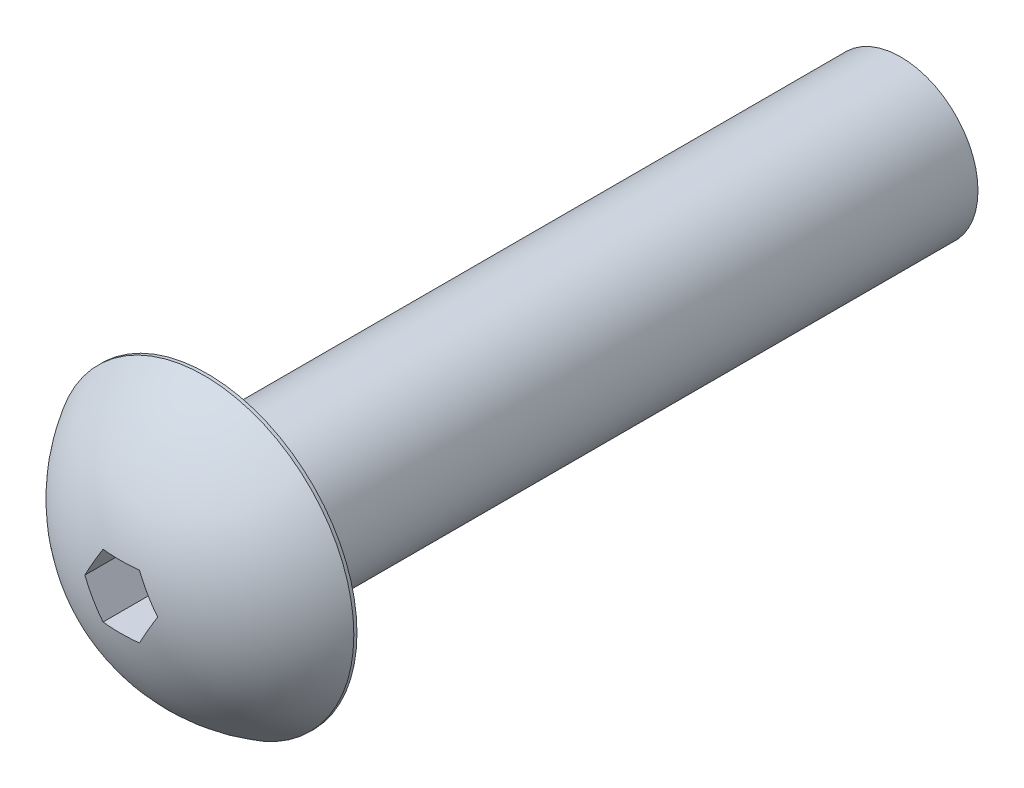
ISO-10303-21;
HEADER;
FILE_DESCRIPTION(('STEP AP214'),'2;1');
FILE_NAME('part.step','',(''),(''),'','','');
FILE_SCHEMA(('AUTOMOTIVE_DESIGN { 1 0 10303 214 1 1 1 1 }'));
ENDSEC;
DATA;
#1=APPLICATION_CONTEXT('core data for automotive mechanical design processes');
#2=APPLICATION_PROTOCOL_DEFINITION('international standard','automotive_design',2000,#1);
#3=PRODUCT_CONTEXT('',#1,'mechanical');
#4=PRODUCT('Part','Part','',(#3));
#5=PRODUCT_RELATED_PRODUCT_CATEGORY('part','',(#4));
#6=PRODUCT_DEFINITION_FORMATION('','',#4);
#7=PRODUCT_DEFINITION_CONTEXT('part definition',#1,'design');
#8=PRODUCT_DEFINITION('design','',#6,#7);
#9=PRODUCT_DEFINITION_SHAPE('','',#8);
#10=(LENGTH_UNIT() NAMED_UNIT(*) SI_UNIT(.MILLI.,.METRE.));
#11=(NAMED_UNIT(*) PLANE_ANGLE_UNIT() SI_UNIT($,.RADIAN.));
#12=(NAMED_UNIT(*) SI_UNIT($,.STERADIAN.) SOLID_ANGLE_UNIT());
#13=UNCERTAINTY_MEASURE_WITH_UNIT(LENGTH_MEASURE(1.E-05),#10,'distance_accuracy_value','');
#14=(GEOMETRIC_REPRESENTATION_CONTEXT(3) GLOBAL_UNCERTAINTY_ASSIGNED_CONTEXT((#13)) GLOBAL_UNIT_ASSIGNED_CONTEXT((#10,
#11,#12)) REPRESENTATION_CONTEXT('',''));
#15=CARTESIAN_POINT('',(0.,0.,0.));
#16=DIRECTION('',(0.,0.,1.));
#17=DIRECTION('',(1.,0.,0.));
#18=AXIS2_PLACEMENT_3D('',#15,#16,#17);
#19=CARTESIAN_POINT('',(0.,0.,22.));
#20=DIRECTION('',(0.,0.,-1.));
#21=DIRECTION('',(-1.,0.,0.));
#22=AXIS2_PLACEMENT_3D('',#19,#20,#21);
#23=CYLINDRICAL_SURFACE('',#22,2.45);
#24=CARTESIAN_POINT('',(0.,0.,22.));
#25=DIRECTION('',(0.,0.,1.));
#26=DIRECTION('',(1.,0.,0.));
#27=AXIS2_PLACEMENT_3D('',#24,#25,#26);
#28=CIRCLE('',#27,2.45);
#29=CARTESIAN_POINT('',(2.45,0.,22.));
#30=VERTEX_POINT('',#29);
#31=EDGE_CURVE('E128',#30,#30,#28,.T.);
#32=ORIENTED_EDGE('',*,*,#31,.F.);
#33=EDGE_LOOP('',(#32));
#34=FACE_BOUND('',#33,.T.);
#35=CARTESIAN_POINT('',(0.,0.,0.));
#36=DIRECTION('',(0.,0.,1.));
#37=DIRECTION('',(1.,0.,0.));
#38=AXIS2_PLACEMENT_3D('',#35,#36,#37);
#39=CIRCLE('',#38,2.45);
#40=CARTESIAN_POINT('',(2.45,0.,0.));
#41=VERTEX_POINT('',#40);
#42=EDGE_CURVE('E131',#41,#41,#39,.T.);
#43=ORIENTED_EDGE('',*,*,#42,.T.);
#44=EDGE_LOOP('',(#43));
#45=FACE_BOUND('',#44,.T.);
#46=ADVANCED_FACE('F35',(#34,#45),#23,.T.);
#47=CARTESIAN_POINT('',(0.,0.,0.));
#48=DIRECTION('',(0.,0.,1.));
#49=DIRECTION('',(1.,0.,0.));
#50=AXIS2_PLACEMENT_3D('',#47,#48,#49);
#51=PLANE('',#50);
#52=ORIENTED_EDGE('',*,*,#42,.F.);
#53=EDGE_LOOP('',(#52));
#54=FACE_BOUND('',#53,.T.);
#55=ADVANCED_FACE('F169',(#54),#51,.F.);
#56=CARTESIAN_POINT('',(0.,0.,22.));
#57=DIRECTION('',(0.,0.,1.));
#58=DIRECTION('',(1.,0.,0.));
#59=AXIS2_PLACEMENT_3D('',#56,#57,#58);
#60=PLANE('',#59);
#61=CARTESIAN_POINT('',(0.,0.,22.));
#62=DIRECTION('',(0.,0.,1.));
#63=DIRECTION('',(1.,0.,0.));
#64=AXIS2_PLACEMENT_3D('',#61,#62,#63);
#65=CIRCLE('',#64,4.75);
#66=CARTESIAN_POINT('',(4.75,0.,22.));
#67=VERTEX_POINT('',#66);
#68=EDGE_CURVE('E117',#67,#67,#65,.T.);
#69=ORIENTED_EDGE('',*,*,#68,.F.);
#70=EDGE_LOOP('',(#69));
#71=FACE_BOUND('',#70,.T.);
#72=ORIENTED_EDGE('',*,*,#31,.T.);
#73=EDGE_LOOP('',(#72));
#74=FACE_BOUND('',#73,.T.);
#75=ADVANCED_FACE('F174',(#71,#74),#60,.F.);
#76=CARTESIAN_POINT('',(0.,0.,22.1));
#77=DIRECTION('',(0.,0.,-1.));
#78=DIRECTION('',(-1.,0.,0.));
#79=AXIS2_PLACEMENT_3D('',#76,#77,#78);
#80=CYLINDRICAL_SURFACE('',#79,4.75);
#81=CARTESIAN_POINT('',(0.,0.,22.1));
#82=DIRECTION('',(0.,0.,1.));
#83=DIRECTION('',(1.,0.,0.));
#84=AXIS2_PLACEMENT_3D('',#81,#82,#83);
#85=CIRCLE('',#84,4.75);
#86=CARTESIAN_POINT('',(4.75,0.,22.1));
#87=VERTEX_POINT('',#86);
#88=EDGE_CURVE('E127',#87,#87,#85,.T.);
#89=ORIENTED_EDGE('',*,*,#88,.F.);
#90=EDGE_LOOP('',(#89));
#91=FACE_BOUND('',#90,.T.);
#92=ORIENTED_EDGE('',*,*,#68,.T.);
#93=EDGE_LOOP('',(#92));
#94=FACE_BOUND('',#93,.T.);
#95=ADVANCED_FACE('F180',(#91,#94),#80,.T.);
#96=CARTESIAN_POINT('',(0.,0.,19.3727272727273));
#97=DIRECTION('',(0.,0.,1.));
#98=DIRECTION('',(1.,0.,0.));
#99=AXIS2_PLACEMENT_3D('',#96,#97,#98);
#100=SPHERICAL_SURFACE('',#99,5.47727272727273);
#101=CARTESIAN_POINT('',(0.,1.,19.3727272727273));
#102=DIRECTION('',(0.,1.,0.));
#103=DIRECTION('',(-1.,0.,0.));
#104=AXIS2_PLACEMENT_3D('',#101,#102,#103);
#105=CIRCLE('',#104,5.38521276542772);
#106=CARTESIAN_POINT('',(0.577350269189626,1.,24.7269016437757));
#107=VERTEX_POINT('',#106);
#108=CARTESIAN_POINT('',(-0.577350269189626,1.,24.7269016437757));
#109=VERTEX_POINT('',#108);
#110=EDGE_CURVE('E11',#107,#109,#105,.F.);
#111=ORIENTED_EDGE('',*,*,#110,.F.);
#112=CARTESIAN_POINT('',(0.866025403784438,0.5,19.3727272727273));
#113=DIRECTION('',(0.866025403784438,0.5,0.));
#114=DIRECTION('',(-0.5,0.866025403784439,0.));
#115=AXIS2_PLACEMENT_3D('',#112,#113,#114);
#116=CIRCLE('',#115,5.38521276542772);
#117=CARTESIAN_POINT('',(1.15470053837925,0.,24.7269016437757));
#118=VERTEX_POINT('',#117);
#119=EDGE_CURVE('E89',#118,#107,#116,.F.);
#120=ORIENTED_EDGE('',*,*,#119,.F.);
#121=CARTESIAN_POINT('',(0.866025403784439,-0.5,19.3727272727273));
#122=DIRECTION('',(0.866025403784439,-0.5,0.));
#123=DIRECTION('',(0.5,0.866025403784439,0.));
#124=AXIS2_PLACEMENT_3D('',#121,#122,#123);
#125=CIRCLE('',#124,5.38521276542772);
#126=CARTESIAN_POINT('',(0.577350269189626,-1.,24.7269016437757));
#127=VERTEX_POINT('',#126);
#128=EDGE_CURVE('E137',#127,#118,#125,.F.);
#129=ORIENTED_EDGE('',*,*,#128,.F.);
#130=CARTESIAN_POINT('',(0.,-1.,19.3727272727273));
#131=DIRECTION('',(0.,-1.,0.));
#132=DIRECTION('',(0.,0.,-1.));
#133=AXIS2_PLACEMENT_3D('',#130,#131,#132);
#134=CIRCLE('',#133,5.38521276542772);
#135=CARTESIAN_POINT('',(-0.577350269189626,-1.,24.7269016437757));
#136=VERTEX_POINT('',#135);
#137=EDGE_CURVE('E139',#136,#127,#134,.F.);
#138=ORIENTED_EDGE('',*,*,#137,.F.);
#139=CARTESIAN_POINT('',(-0.866025403784438,-0.5,19.3727272727273));
#140=DIRECTION('',(-0.866025403784438,-0.5,0.));
#141=DIRECTION('',(0.5,-0.866025403784439,0.));
#142=AXIS2_PLACEMENT_3D('',#139,#140,#141);
#143=CIRCLE('',#142,5.38521276542772);
#144=CARTESIAN_POINT('',(-1.15470053837925,0.,24.7269016437757));
#145=VERTEX_POINT('',#144);
#146=EDGE_CURVE('E141',#145,#136,#143,.F.);
#147=ORIENTED_EDGE('',*,*,#146,.F.);
#148=CARTESIAN_POINT('',(-0.866025403784439,0.5,19.3727272727273));
#149=DIRECTION('',(-0.866025403784439,0.5,0.));
#150=DIRECTION('',(-0.5,-0.866025403784439,0.));
#151=AXIS2_PLACEMENT_3D('',#148,#149,#150);
#152=CIRCLE('',#151,5.38521276542772);
#153=EDGE_CURVE('E43',#109,#145,#152,.F.);
#154=ORIENTED_EDGE('',*,*,#153,.F.);
#155=EDGE_LOOP('',(#111,#120,#129,#138,#147,#154));
#156=FACE_BOUND('',#155,.T.);
#157=ORIENTED_EDGE('',*,*,#88,.T.);
#158=EDGE_LOOP('',(#157));
#159=FACE_BOUND('',#158,.T.);
#160=ADVANCED_FACE('F37',(#156,#159),#100,.T.);
#161=CARTESIAN_POINT('',(-0.577350269189626,1.,24.85));
#162=DIRECTION('',(0.,1.,0.));
#163=DIRECTION('',(-1.,0.,0.));
#164=AXIS2_PLACEMENT_3D('',#161,#162,#163);
#165=PLANE('',#164);
#166=ORIENTED_EDGE('',*,*,#110,.T.);
#167=DIRECTION('',(0.,0.,-1.));
#168=VECTOR('',#167,1.);
#169=CARTESIAN_POINT('',(-0.577350269189626,1.,24.85));
#170=LINE('',#169,#168);
#171=CARTESIAN_POINT('',(-0.577350269189626,1.,22.));
#172=VERTEX_POINT('',#171);
#173=EDGE_CURVE('E105',#109,#172,#170,.T.);
#174=ORIENTED_EDGE('',*,*,#173,.T.);
#175=DIRECTION('',(1.,0.,0.));
#176=VECTOR('',#175,1.);
#177=CARTESIAN_POINT('',(-0.577350269189626,1.,22.));
#178=LINE('',#177,#176);
#179=CARTESIAN_POINT('',(0.577350269189626,1.,22.));
#180=VERTEX_POINT('',#179);
#181=EDGE_CURVE('E98',#172,#180,#178,.T.);
#182=ORIENTED_EDGE('',*,*,#181,.T.);
#183=DIRECTION('',(0.,0.,-1.));
#184=VECTOR('',#183,1.);
#185=CARTESIAN_POINT('',(0.577350269189626,1.,24.85));
#186=LINE('',#185,#184);
#187=EDGE_CURVE('E84',#107,#180,#186,.T.);
#188=ORIENTED_EDGE('',*,*,#187,.F.);
#189=EDGE_LOOP('',(#166,#174,#182,#188));
#190=FACE_BOUND('',#189,.T.);
#191=ADVANCED_FACE('F104',(#190),#165,.F.);
#192=CARTESIAN_POINT('',(-1.15470053837925,0.,24.85));
#193=DIRECTION('',(-0.866025403784439,0.5,0.));
#194=DIRECTION('',(-0.5,-0.866025403784439,0.));
#195=AXIS2_PLACEMENT_3D('',#192,#193,#194);
#196=PLANE('',#195);
#197=ORIENTED_EDGE('',*,*,#153,.T.);
#198=DIRECTION('',(0.,0.,-1.));
#199=VECTOR('',#198,1.);
#200=CARTESIAN_POINT('',(-1.15470053837925,0.,24.85));
#201=LINE('',#200,#199);
#202=CARTESIAN_POINT('',(-1.15470053837925,0.,22.));
#203=VERTEX_POINT('',#202);
#204=EDGE_CURVE('E118',#145,#203,#201,.T.);
#205=ORIENTED_EDGE('',*,*,#204,.T.);
#206=DIRECTION('',(0.5,0.866025403784439,0.));
#207=VECTOR('',#206,1.);
#208=CARTESIAN_POINT('',(-1.15470053837925,0.,22.));
#209=LINE('',#208,#207);
#210=EDGE_CURVE('E91',#203,#172,#209,.T.);
#211=ORIENTED_EDGE('',*,*,#210,.T.);
#212=ORIENTED_EDGE('',*,*,#173,.F.);
#213=EDGE_LOOP('',(#197,#205,#211,#212));
#214=FACE_BOUND('',#213,.T.);
#215=ADVANCED_FACE('F145',(#214),#196,.F.);
#216=CARTESIAN_POINT('',(-0.577350269189626,-1.,24.85));
#217=DIRECTION('',(-0.866025403784438,-0.5,0.));
#218=DIRECTION('',(0.5,-0.866025403784439,0.));
#219=AXIS2_PLACEMENT_3D('',#216,#217,#218);
#220=PLANE('',#219);
#221=ORIENTED_EDGE('',*,*,#146,.T.);
#222=DIRECTION('',(0.,0.,-1.));
#223=VECTOR('',#222,1.);
#224=CARTESIAN_POINT('',(-0.577350269189626,-1.,24.85));
#225=LINE('',#224,#223);
#226=CARTESIAN_POINT('',(-0.577350269189626,-1.,22.));
#227=VERTEX_POINT('',#226);
#228=EDGE_CURVE('E120',#136,#227,#225,.T.);
#229=ORIENTED_EDGE('',*,*,#228,.T.);
#230=DIRECTION('',(-0.5,0.866025403784439,0.));
#231=VECTOR('',#230,1.);
#232=CARTESIAN_POINT('',(-0.577350269189626,-1.,22.));
#233=LINE('',#232,#231);
#234=EDGE_CURVE('E112',#227,#203,#233,.T.);
#235=ORIENTED_EDGE('',*,*,#234,.T.);
#236=ORIENTED_EDGE('',*,*,#204,.F.);
#237=EDGE_LOOP('',(#221,#229,#235,#236));
#238=FACE_BOUND('',#237,.T.);
#239=ADVANCED_FACE('F149',(#238),#220,.F.);
#240=CARTESIAN_POINT('',(0.577350269189626,-1.,24.85));
#241=DIRECTION('',(0.,-1.,0.));
#242=DIRECTION('',(0.,0.,-1.));
#243=AXIS2_PLACEMENT_3D('',#240,#241,#242);
#244=PLANE('',#243);
#245=ORIENTED_EDGE('',*,*,#137,.T.);
#246=DIRECTION('',(0.,0.,-1.));
#247=VECTOR('',#246,1.);
#248=CARTESIAN_POINT('',(0.577350269189626,-1.,24.85));
#249=LINE('',#248,#247);
#250=CARTESIAN_POINT('',(0.577350269189626,-1.,22.));
#251=VERTEX_POINT('',#250);
#252=EDGE_CURVE('E122',#127,#251,#249,.T.);
#253=ORIENTED_EDGE('',*,*,#252,.T.);
#254=DIRECTION('',(-1.,0.,0.));
#255=VECTOR('',#254,1.);
#256=CARTESIAN_POINT('',(0.577350269189626,-1.,22.));
#257=LINE('',#256,#255);
#258=EDGE_CURVE('E109',#251,#227,#257,.T.);
#259=ORIENTED_EDGE('',*,*,#258,.T.);
#260=ORIENTED_EDGE('',*,*,#228,.F.);
#261=EDGE_LOOP('',(#245,#253,#259,#260));
#262=FACE_BOUND('',#261,.T.);
#263=ADVANCED_FACE('F157',(#262),#244,.F.);
#264=CARTESIAN_POINT('',(1.15470053837925,0.,24.85));
#265=DIRECTION('',(0.866025403784439,-0.5,0.));
#266=DIRECTION('',(0.5,0.866025403784439,0.));
#267=AXIS2_PLACEMENT_3D('',#264,#265,#266);
#268=PLANE('',#267);
#269=ORIENTED_EDGE('',*,*,#128,.T.);
#270=DIRECTION('',(0.,0.,-1.));
#271=VECTOR('',#270,1.);
#272=CARTESIAN_POINT('',(1.15470053837925,0.,24.85));
#273=LINE('',#272,#271);
#274=CARTESIAN_POINT('',(1.15470053837925,0.,22.));
#275=VERTEX_POINT('',#274);
#276=EDGE_CURVE('E50',#118,#275,#273,.T.);
#277=ORIENTED_EDGE('',*,*,#276,.T.);
#278=DIRECTION('',(-0.5,-0.866025403784439,0.));
#279=VECTOR('',#278,1.);
#280=CARTESIAN_POINT('',(1.15470053837925,0.,22.));
#281=LINE('',#280,#279);
#282=EDGE_CURVE('E102',#275,#251,#281,.T.);
#283=ORIENTED_EDGE('',*,*,#282,.T.);
#284=ORIENTED_EDGE('',*,*,#252,.F.);
#285=EDGE_LOOP('',(#269,#277,#283,#284));
#286=FACE_BOUND('',#285,.T.);
#287=ADVANCED_FACE('F159',(#286),#268,.F.);
#288=CARTESIAN_POINT('',(0.577350269189626,1.,24.85));
#289=DIRECTION('',(0.866025403784438,0.5,0.));
#290=DIRECTION('',(-0.5,0.866025403784439,0.));
#291=AXIS2_PLACEMENT_3D('',#288,#289,#290);
#292=PLANE('',#291);
#293=ORIENTED_EDGE('',*,*,#119,.T.);
#294=ORIENTED_EDGE('',*,*,#187,.T.);
#295=DIRECTION('',(0.5,-0.866025403784438,0.));
#296=VECTOR('',#295,1.);
#297=CARTESIAN_POINT('',(0.577350269189626,1.,22.));
#298=LINE('',#297,#296);
#299=EDGE_CURVE('E87',#180,#275,#298,.T.);
#300=ORIENTED_EDGE('',*,*,#299,.T.);
#301=ORIENTED_EDGE('',*,*,#276,.F.);
#302=EDGE_LOOP('',(#293,#294,#300,#301));
#303=FACE_BOUND('',#302,.T.);
#304=ADVANCED_FACE('F86',(#303),#292,.F.);
#305=CARTESIAN_POINT('',(0.577350269189626,1.,22.));
#306=DIRECTION('',(0.,0.,-1.));
#307=DIRECTION('',(-1.,0.,0.));
#308=AXIS2_PLACEMENT_3D('',#305,#306,#307);
#309=PLANE('',#308);
#310=ORIENTED_EDGE('',*,*,#181,.F.);
#311=ORIENTED_EDGE('',*,*,#210,.F.);
#312=ORIENTED_EDGE('',*,*,#234,.F.);
#313=ORIENTED_EDGE('',*,*,#258,.F.);
#314=ORIENTED_EDGE('',*,*,#282,.F.);
#315=ORIENTED_EDGE('',*,*,#299,.F.);
#316=EDGE_LOOP('',(#310,#311,#312,#313,#314,#315));
#317=FACE_BOUND('',#316,.T.);
#318=ADVANCED_FACE('F96',(#317),#309,.F.);
#319=CLOSED_SHELL('',(#46,#55,#75,#95,#160,#191,#215,#239,#263,#287,#304,#318));
#320=MANIFOLD_SOLID_BREP('B2',#319);
#321=ADVANCED_BREP_SHAPE_REPRESENTATION('',(#18,#320),#14);
#322=SHAPE_DEFINITION_REPRESENTATION(#9,#321);
ENDSEC;
END-ISO-10303-21;
